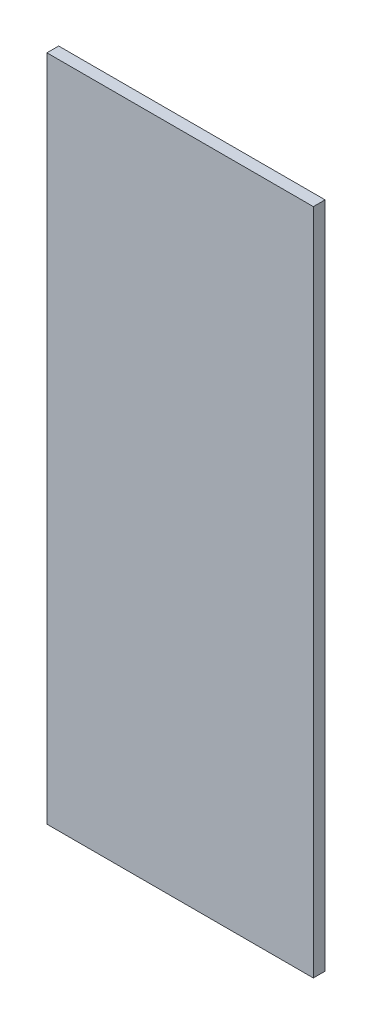
ISO-10303-21;
HEADER;
FILE_DESCRIPTION(('STEP AP214'),'2;1');
FILE_NAME('part.step','',(''),(''),'','','');
FILE_SCHEMA(('AUTOMOTIVE_DESIGN { 1 0 10303 214 1 1 1 1 }'));
ENDSEC;
DATA;
#1=APPLICATION_CONTEXT('core data for automotive mechanical design processes');
#2=APPLICATION_PROTOCOL_DEFINITION('international standard','automotive_design',2000,#1);
#3=PRODUCT_CONTEXT('',#1,'mechanical');
#4=PRODUCT('Part','Part','',(#3));
#5=PRODUCT_RELATED_PRODUCT_CATEGORY('part','',(#4));
#6=PRODUCT_DEFINITION_FORMATION('','',#4);
#7=PRODUCT_DEFINITION_CONTEXT('part definition',#1,'design');
#8=PRODUCT_DEFINITION('design','',#6,#7);
#9=PRODUCT_DEFINITION_SHAPE('','',#8);
#10=(LENGTH_UNIT() NAMED_UNIT(*) SI_UNIT(.MILLI.,.METRE.));
#11=(NAMED_UNIT(*) PLANE_ANGLE_UNIT() SI_UNIT($,.RADIAN.));
#12=(NAMED_UNIT(*) SI_UNIT($,.STERADIAN.) SOLID_ANGLE_UNIT());
#13=UNCERTAINTY_MEASURE_WITH_UNIT(LENGTH_MEASURE(1.E-05),#10,'distance_accuracy_value','');
#14=(GEOMETRIC_REPRESENTATION_CONTEXT(3) GLOBAL_UNCERTAINTY_ASSIGNED_CONTEXT((#13)) GLOBAL_UNIT_ASSIGNED_CONTEXT((#10,
#11,#12)) REPRESENTATION_CONTEXT('',''));
#15=CARTESIAN_POINT('',(0.,0.,0.));
#16=DIRECTION('',(0.,0.,1.));
#17=DIRECTION('',(1.,0.,0.));
#18=AXIS2_PLACEMENT_3D('',#15,#16,#17);
#19=CARTESIAN_POINT('',(-204.,-511.5,18.));
#20=DIRECTION('',(1.,0.,0.));
#21=DIRECTION('',(0.,0.,-1.));
#22=AXIS2_PLACEMENT_3D('',#19,#20,#21);
#23=PLANE('',#22);
#24=DIRECTION('',(0.,-1.,0.));
#25=VECTOR('',#24,1.);
#26=CARTESIAN_POINT('',(-204.,-511.5,0.));
#27=LINE('',#26,#25);
#28=CARTESIAN_POINT('',(-204.,511.5,0.));
#29=VERTEX_POINT('',#28);
#30=CARTESIAN_POINT('',(-204.,-511.5,0.));
#31=VERTEX_POINT('',#30);
#32=EDGE_CURVE('E95',#29,#31,#27,.T.);
#33=ORIENTED_EDGE('',*,*,#32,.T.);
#34=DIRECTION('',(0.,0.,-1.));
#35=VECTOR('',#34,1.);
#36=CARTESIAN_POINT('',(-204.,-511.5,18.));
#37=LINE('',#36,#35);
#38=CARTESIAN_POINT('',(-204.,-511.5,18.));
#39=VERTEX_POINT('',#38);
#40=EDGE_CURVE('E11',#39,#31,#37,.T.);
#41=ORIENTED_EDGE('',*,*,#40,.F.);
#42=DIRECTION('',(0.,-1.,0.));
#43=VECTOR('',#42,1.);
#44=CARTESIAN_POINT('',(-204.,-511.5,18.));
#45=LINE('',#44,#43);
#46=CARTESIAN_POINT('',(-204.,511.5,18.));
#47=VERTEX_POINT('',#46);
#48=EDGE_CURVE('E83',#47,#39,#45,.T.);
#49=ORIENTED_EDGE('',*,*,#48,.F.);
#50=DIRECTION('',(0.,0.,-1.));
#51=VECTOR('',#50,1.);
#52=CARTESIAN_POINT('',(-204.,511.5,18.));
#53=LINE('',#52,#51);
#54=EDGE_CURVE('E91',#47,#29,#53,.T.);
#55=ORIENTED_EDGE('',*,*,#54,.T.);
#56=EDGE_LOOP('',(#33,#41,#49,#55));
#57=FACE_BOUND('',#56,.T.);
#58=ADVANCED_FACE('F32',(#57),#23,.F.);
#59=CARTESIAN_POINT('',(204.,-511.5,18.));
#60=DIRECTION('',(0.,1.,0.));
#61=DIRECTION('',(-1.,0.,0.));
#62=AXIS2_PLACEMENT_3D('',#59,#60,#61);
#63=PLANE('',#62);
#64=DIRECTION('',(1.,0.,0.));
#65=VECTOR('',#64,1.);
#66=CARTESIAN_POINT('',(204.,-511.5,0.));
#67=LINE('',#66,#65);
#68=CARTESIAN_POINT('',(204.,-511.5,0.));
#69=VERTEX_POINT('',#68);
#70=EDGE_CURVE('E87',#31,#69,#67,.T.);
#71=ORIENTED_EDGE('',*,*,#70,.T.);
#72=DIRECTION('',(0.,0.,-1.));
#73=VECTOR('',#72,1.);
#74=CARTESIAN_POINT('',(204.,-511.5,18.));
#75=LINE('',#74,#73);
#76=CARTESIAN_POINT('',(204.,-511.5,18.));
#77=VERTEX_POINT('',#76);
#78=EDGE_CURVE('E40',#77,#69,#75,.T.);
#79=ORIENTED_EDGE('',*,*,#78,.F.);
#80=DIRECTION('',(1.,0.,0.));
#81=VECTOR('',#80,1.);
#82=CARTESIAN_POINT('',(204.,-511.5,18.));
#83=LINE('',#82,#81);
#84=EDGE_CURVE('E78',#39,#77,#83,.T.);
#85=ORIENTED_EDGE('',*,*,#84,.F.);
#86=ORIENTED_EDGE('',*,*,#40,.T.);
#87=EDGE_LOOP('',(#71,#79,#85,#86));
#88=FACE_BOUND('',#87,.T.);
#89=ADVANCED_FACE('F86',(#88),#63,.F.);
#90=CARTESIAN_POINT('',(204.,-511.5,18.));
#91=DIRECTION('',(-1.,0.,0.));
#92=DIRECTION('',(0.,0.,1.));
#93=AXIS2_PLACEMENT_3D('',#90,#91,#92);
#94=PLANE('',#93);
#95=DIRECTION('',(0.,1.,0.));
#96=VECTOR('',#95,1.);
#97=CARTESIAN_POINT('',(204.,-511.5,0.));
#98=LINE('',#97,#96);
#99=CARTESIAN_POINT('',(204.,511.5,0.));
#100=VERTEX_POINT('',#99);
#101=EDGE_CURVE('E65',#69,#100,#98,.T.);
#102=ORIENTED_EDGE('',*,*,#101,.T.);
#103=DIRECTION('',(0.,0.,-1.));
#104=VECTOR('',#103,1.);
#105=CARTESIAN_POINT('',(204.,511.5,18.));
#106=LINE('',#105,#104);
#107=CARTESIAN_POINT('',(204.,511.5,18.));
#108=VERTEX_POINT('',#107);
#109=EDGE_CURVE('E88',#108,#100,#106,.T.);
#110=ORIENTED_EDGE('',*,*,#109,.F.);
#111=DIRECTION('',(0.,1.,0.));
#112=VECTOR('',#111,1.);
#113=CARTESIAN_POINT('',(204.,-511.5,18.));
#114=LINE('',#113,#112);
#115=EDGE_CURVE('E81',#77,#108,#114,.T.);
#116=ORIENTED_EDGE('',*,*,#115,.F.);
#117=ORIENTED_EDGE('',*,*,#78,.T.);
#118=EDGE_LOOP('',(#102,#110,#116,#117));
#119=FACE_BOUND('',#118,.T.);
#120=ADVANCED_FACE('F89',(#119),#94,.F.);
#121=CARTESIAN_POINT('',(204.,511.5,18.));
#122=DIRECTION('',(0.,-1.,0.));
#123=DIRECTION('',(1.,0.,0.));
#124=AXIS2_PLACEMENT_3D('',#121,#122,#123);
#125=PLANE('',#124);
#126=DIRECTION('',(-1.,0.,0.));
#127=VECTOR('',#126,1.);
#128=CARTESIAN_POINT('',(204.,511.5,0.));
#129=LINE('',#128,#127);
#130=EDGE_CURVE('E71',#100,#29,#129,.T.);
#131=ORIENTED_EDGE('',*,*,#130,.T.);
#132=ORIENTED_EDGE('',*,*,#54,.F.);
#133=DIRECTION('',(-1.,0.,0.));
#134=VECTOR('',#133,1.);
#135=CARTESIAN_POINT('',(204.,511.5,18.));
#136=LINE('',#135,#134);
#137=EDGE_CURVE('E48',#108,#47,#136,.T.);
#138=ORIENTED_EDGE('',*,*,#137,.F.);
#139=ORIENTED_EDGE('',*,*,#109,.T.);
#140=EDGE_LOOP('',(#131,#132,#138,#139));
#141=FACE_BOUND('',#140,.T.);
#142=ADVANCED_FACE('F102',(#141),#125,.F.);
#143=CARTESIAN_POINT('',(0.,0.,18.));
#144=DIRECTION('',(0.,0.,1.));
#145=DIRECTION('',(1.,0.,0.));
#146=AXIS2_PLACEMENT_3D('',#143,#144,#145);
#147=PLANE('',#146);
#148=ORIENTED_EDGE('',*,*,#48,.T.);
#149=ORIENTED_EDGE('',*,*,#84,.T.);
#150=ORIENTED_EDGE('',*,*,#115,.T.);
#151=ORIENTED_EDGE('',*,*,#137,.T.);
#152=EDGE_LOOP('',(#148,#149,#150,#151));
#153=FACE_BOUND('',#152,.T.);
#154=ADVANCED_FACE('F79',(#153),#147,.T.);
#155=CARTESIAN_POINT('',(0.,0.,0.));
#156=DIRECTION('',(0.,0.,1.));
#157=DIRECTION('',(1.,0.,0.));
#158=AXIS2_PLACEMENT_3D('',#155,#156,#157);
#159=PLANE('',#158);
#160=ORIENTED_EDGE('',*,*,#32,.F.);
#161=ORIENTED_EDGE('',*,*,#130,.F.);
#162=ORIENTED_EDGE('',*,*,#101,.F.);
#163=ORIENTED_EDGE('',*,*,#70,.F.);
#164=EDGE_LOOP('',(#160,#161,#162,#163));
#165=FACE_BOUND('',#164,.T.);
#166=ADVANCED_FACE('F105',(#165),#159,.F.);
#167=CLOSED_SHELL('',(#58,#89,#120,#142,#154,#166));
#168=MANIFOLD_SOLID_BREP('B2',#167);
#169=ADVANCED_BREP_SHAPE_REPRESENTATION('',(#18,#168),#14);
#170=SHAPE_DEFINITION_REPRESENTATION(#9,#169);
ENDSEC;
END-ISO-10303-21;
